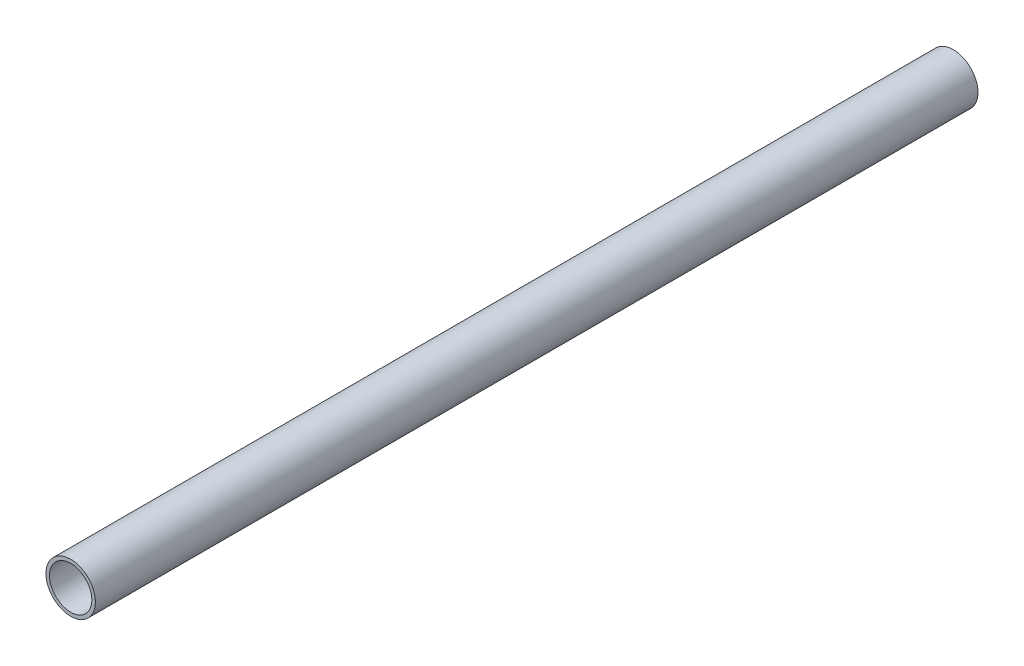
ISO-10303-21;
HEADER;
FILE_DESCRIPTION(('STEP AP214'),'2;1');
FILE_NAME('part.step','',(''),(''),'','','');
FILE_SCHEMA(('AUTOMOTIVE_DESIGN { 1 0 10303 214 1 1 1 1 }'));
ENDSEC;
DATA;
#1=APPLICATION_CONTEXT('core data for automotive mechanical design processes');
#2=APPLICATION_PROTOCOL_DEFINITION('international standard','automotive_design',2000,#1);
#3=PRODUCT_CONTEXT('',#1,'mechanical');
#4=PRODUCT('Part','Part','',(#3));
#5=PRODUCT_RELATED_PRODUCT_CATEGORY('part','',(#4));
#6=PRODUCT_DEFINITION_FORMATION('','',#4);
#7=PRODUCT_DEFINITION_CONTEXT('part definition',#1,'design');
#8=PRODUCT_DEFINITION('design','',#6,#7);
#9=PRODUCT_DEFINITION_SHAPE('','',#8);
#10=(LENGTH_UNIT() NAMED_UNIT(*) SI_UNIT(.MILLI.,.METRE.));
#11=(NAMED_UNIT(*) PLANE_ANGLE_UNIT() SI_UNIT($,.RADIAN.));
#12=(NAMED_UNIT(*) SI_UNIT($,.STERADIAN.) SOLID_ANGLE_UNIT());
#13=UNCERTAINTY_MEASURE_WITH_UNIT(LENGTH_MEASURE(1.E-05),#10,'distance_accuracy_value','');
#14=(GEOMETRIC_REPRESENTATION_CONTEXT(3) GLOBAL_UNCERTAINTY_ASSIGNED_CONTEXT((#13)) GLOBAL_UNIT_ASSIGNED_CONTEXT((#10,
#11,#12)) REPRESENTATION_CONTEXT('',''));
#15=CARTESIAN_POINT('',(0.,0.,0.));
#16=DIRECTION('',(0.,0.,1.));
#17=DIRECTION('',(1.,0.,0.));
#18=AXIS2_PLACEMENT_3D('',#15,#16,#17);
#19=CARTESIAN_POINT('',(0.,0.,500.));
#20=DIRECTION('',(0.,0.,-1.));
#21=DIRECTION('',(-1.,0.,0.));
#22=AXIS2_PLACEMENT_3D('',#19,#20,#21);
#23=CYLINDRICAL_SURFACE('',#22,14.);
#24=CARTESIAN_POINT('',(0.,0.,500.));
#25=DIRECTION('',(0.,0.,1.));
#26=DIRECTION('',(1.,0.,0.));
#27=AXIS2_PLACEMENT_3D('',#24,#25,#26);
#28=CIRCLE('',#27,14.);
#29=CARTESIAN_POINT('',(14.,0.,500.));
#30=VERTEX_POINT('',#29);
#31=EDGE_CURVE('E10',#30,#30,#28,.T.);
#32=ORIENTED_EDGE('',*,*,#31,.F.);
#33=EDGE_LOOP('',(#32));
#34=FACE_BOUND('',#33,.T.);
#35=CARTESIAN_POINT('',(0.,0.,0.));
#36=DIRECTION('',(0.,0.,1.));
#37=DIRECTION('',(1.,0.,0.));
#38=AXIS2_PLACEMENT_3D('',#35,#36,#37);
#39=CIRCLE('',#38,14.);
#40=CARTESIAN_POINT('',(14.,0.,0.));
#41=VERTEX_POINT('',#40);
#42=EDGE_CURVE('E36',#41,#41,#39,.T.);
#43=ORIENTED_EDGE('',*,*,#42,.T.);
#44=EDGE_LOOP('',(#43));
#45=FACE_BOUND('',#44,.T.);
#46=ADVANCED_FACE('F33',(#34,#45),#23,.T.);
#47=CARTESIAN_POINT('',(0.,0.,500.));
#48=DIRECTION('',(0.,0.,1.));
#49=DIRECTION('',(1.,0.,0.));
#50=AXIS2_PLACEMENT_3D('',#47,#48,#49);
#51=PLANE('',#50);
#52=CARTESIAN_POINT('',(0.,0.,500.));
#53=DIRECTION('',(0.,0.,-1.));
#54=DIRECTION('',(-1.,0.,0.));
#55=AXIS2_PLACEMENT_3D('',#52,#53,#54);
#56=CIRCLE('',#55,12.);
#57=CARTESIAN_POINT('',(-12.,0.,500.));
#58=VERTEX_POINT('',#57);
#59=EDGE_CURVE('E43',#58,#58,#56,.T.);
#60=ORIENTED_EDGE('',*,*,#59,.T.);
#61=EDGE_LOOP('',(#60));
#62=FACE_BOUND('',#61,.T.);
#63=ORIENTED_EDGE('',*,*,#31,.T.);
#64=EDGE_LOOP('',(#63));
#65=FACE_BOUND('',#64,.T.);
#66=ADVANCED_FACE('F51',(#62,#65),#51,.T.);
#67=CARTESIAN_POINT('',(0.,0.,0.));
#68=DIRECTION('',(0.,0.,1.));
#69=DIRECTION('',(1.,0.,0.));
#70=AXIS2_PLACEMENT_3D('',#67,#68,#69);
#71=PLANE('',#70);
#72=CARTESIAN_POINT('',(0.,0.,0.));
#73=DIRECTION('',(0.,0.,-1.));
#74=DIRECTION('',(-1.,0.,0.));
#75=AXIS2_PLACEMENT_3D('',#72,#73,#74);
#76=CIRCLE('',#75,12.);
#77=CARTESIAN_POINT('',(-12.,0.,0.));
#78=VERTEX_POINT('',#77);
#79=EDGE_CURVE('E45',#78,#78,#76,.T.);
#80=ORIENTED_EDGE('',*,*,#79,.F.);
#81=EDGE_LOOP('',(#80));
#82=FACE_BOUND('',#81,.T.);
#83=ORIENTED_EDGE('',*,*,#42,.F.);
#84=EDGE_LOOP('',(#83));
#85=FACE_BOUND('',#84,.T.);
#86=ADVANCED_FACE('F56',(#82,#85),#71,.F.);
#87=CARTESIAN_POINT('',(0.,0.,500.));
#88=DIRECTION('',(0.,0.,-1.));
#89=DIRECTION('',(-1.,0.,0.));
#90=AXIS2_PLACEMENT_3D('',#87,#88,#89);
#91=CYLINDRICAL_SURFACE('',#90,12.);
#92=ORIENTED_EDGE('',*,*,#59,.F.);
#93=EDGE_LOOP('',(#92));
#94=FACE_BOUND('',#93,.T.);
#95=ORIENTED_EDGE('',*,*,#79,.T.);
#96=EDGE_LOOP('',(#95));
#97=FACE_BOUND('',#96,.T.);
#98=ADVANCED_FACE('F53',(#94,#97),#91,.F.);
#99=CLOSED_SHELL('',(#46,#66,#86,#98));
#100=MANIFOLD_SOLID_BREP('B2',#99);
#101=ADVANCED_BREP_SHAPE_REPRESENTATION('',(#18,#100),#14);
#102=SHAPE_DEFINITION_REPRESENTATION(#9,#101);
ENDSEC;
END-ISO-10303-21;
